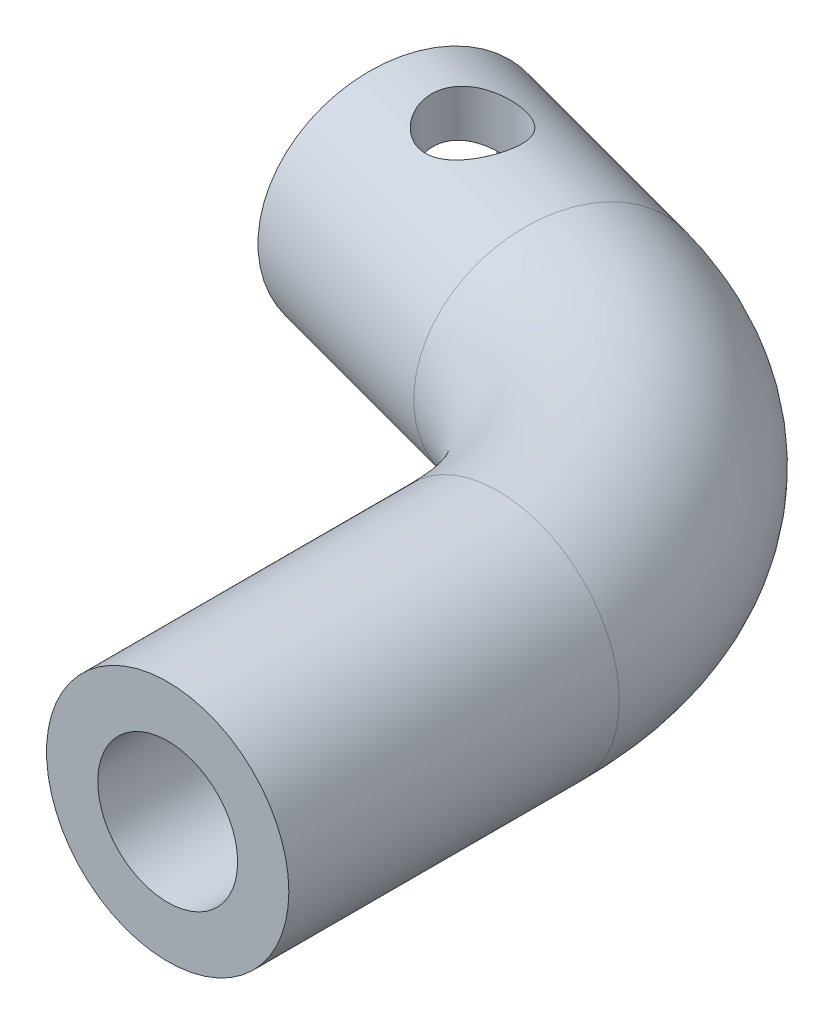
ISO-10303-21;
HEADER;
FILE_DESCRIPTION(('STEP AP214'),'2;1');
FILE_NAME('part.step','',(''),(''),'','','');
FILE_SCHEMA(('AUTOMOTIVE_DESIGN { 1 0 10303 214 1 1 1 1 }'));
ENDSEC;
DATA;
#1=APPLICATION_CONTEXT('core data for automotive mechanical design processes');
#2=APPLICATION_PROTOCOL_DEFINITION('international standard','automotive_design',2000,#1);
#3=PRODUCT_CONTEXT('',#1,'mechanical');
#4=PRODUCT('Part','Part','',(#3));
#5=PRODUCT_RELATED_PRODUCT_CATEGORY('part','',(#4));
#6=PRODUCT_DEFINITION_FORMATION('','',#4);
#7=PRODUCT_DEFINITION_CONTEXT('part definition',#1,'design');
#8=PRODUCT_DEFINITION('design','',#6,#7);
#9=PRODUCT_DEFINITION_SHAPE('','',#8);
#10=(LENGTH_UNIT() NAMED_UNIT(*) SI_UNIT(.MILLI.,.METRE.));
#11=(NAMED_UNIT(*) PLANE_ANGLE_UNIT() SI_UNIT($,.RADIAN.));
#12=(NAMED_UNIT(*) SI_UNIT($,.STERADIAN.) SOLID_ANGLE_UNIT());
#13=UNCERTAINTY_MEASURE_WITH_UNIT(LENGTH_MEASURE(1.E-05),#10,'distance_accuracy_value','');
#14=(GEOMETRIC_REPRESENTATION_CONTEXT(3) GLOBAL_UNCERTAINTY_ASSIGNED_CONTEXT((#13)) GLOBAL_UNIT_ASSIGNED_CONTEXT((#10,
#11,#12)) REPRESENTATION_CONTEXT('',''));
#15=CARTESIAN_POINT('',(0.,0.,0.));
#16=DIRECTION('',(0.,0.,1.));
#17=DIRECTION('',(1.,0.,0.));
#18=AXIS2_PLACEMENT_3D('',#15,#16,#17);
#19=CARTESIAN_POINT('',(-7.0866566905239,0.,-2.49357423980866));
#20=DIRECTION('',(-0.965925826289068,0.,-0.258819045102522));
#21=DIRECTION('',(-0.258819045102522,0.,0.965925826289068));
#22=AXIS2_PLACEMENT_3D('',#19,#20,#21);
#23=CYLINDRICAL_SURFACE('',#22,3.4);
#24=CARTESIAN_POINT('',(-16.7459149534146,0.,-5.08176469083388));
#25=DIRECTION('',(-0.965925826289068,0.,-0.258819045102522));
#26=DIRECTION('',(-0.258819045102522,0.,0.965925826289068));
#27=AXIS2_PLACEMENT_3D('',#24,#25,#26);
#28=CIRCLE('',#27,3.4);
#29=CARTESIAN_POINT('',(-17.6258997067632,0.,-1.79761688145105));
#30=VERTEX_POINT('',#29);
#31=EDGE_CURVE('E120',#30,#30,#28,.T.);
#32=ORIENTED_EDGE('',*,*,#31,.T.);
#33=EDGE_LOOP('',(#32));
#34=FACE_BOUND('',#33,.T.);
#35=CARTESIAN_POINT('',(-12.6434874238193,2.79784724251184,-5.98252254727162));
#36=CARTESIAN_POINT('',(-12.5509977166354,2.78132692335799,-5.98251502304865));
#37=CARTESIAN_POINT('',(-12.4577247348945,2.76851473526521,-5.97607794566917));
#38=CARTESIAN_POINT('',(-12.2721088046783,2.75210078506773,-5.94997631075224));
#39=CARTESIAN_POINT('',(-12.1797670375902,2.74850953894781,-5.93029668304177));
#40=CARTESIAN_POINT('',(-11.9989245557529,2.75110334034966,-5.87814641710598));
#41=CARTESIAN_POINT('',(-11.9104232637114,2.75728691327428,-5.84567770875418));
#42=CARTESIAN_POINT('',(-11.7397605562056,2.77850448159949,-5.76915027512407));
#43=CARTESIAN_POINT('',(-11.6576008761873,2.79354089002309,-5.72508839169848));
#44=CARTESIAN_POINT('',(-11.5008705730949,2.8306112843717,-5.62661784003263));
#45=CARTESIAN_POINT('',(-11.4263460469604,2.852684803993,-5.57215143050944));
#46=CARTESIAN_POINT('',(-11.2863319423716,2.90147030908366,-5.45442852357142));
#47=CARTESIAN_POINT('',(-11.2208468192558,2.92818456733291,-5.39116772219108));
#48=CARTESIAN_POINT('',(-11.0886269321509,2.988978415785,-5.24497227171155));
#49=CARTESIAN_POINT('',(-11.0237556725078,3.02352153529389,-5.16054148040168));
#50=CARTESIAN_POINT('',(-10.9081243960077,3.092587177802,-4.98242442086191));
#51=CARTESIAN_POINT('',(-10.8573768783587,3.12710965574813,-4.8887300533005));
#52=CARTESIAN_POINT('',(-10.7663891199434,3.19669177768806,-4.68287444816542));
#53=CARTESIAN_POINT('',(-10.7278901286475,3.23140206920926,-4.56981288056805));
#54=CARTESIAN_POINT('',(-10.6714515971457,3.29321678870814,-4.33667194321603));
#55=CARTESIAN_POINT('',(-10.6534951437899,3.32032745972455,-4.21659843229962));
#56=CARTESIAN_POINT('',(-10.6403752062763,3.36183481262386,-3.983440735266));
#57=CARTESIAN_POINT('',(-10.6434214662416,3.37710914484058,-3.87061825108027));
#58=CARTESIAN_POINT('',(-10.6687445528547,3.39673788960293,-3.64621390600621));
#59=CARTESIAN_POINT('',(-10.6910028660674,3.40110279909627,-3.53463095547395));
#60=CARTESIAN_POINT('',(-10.7501470904206,3.39858016841131,-3.33049576159959));
#61=CARTESIAN_POINT('',(-10.7848869735867,3.39301574638088,-3.23729512980829));
#62=CARTESIAN_POINT('',(-10.8673697339945,3.37366431697893,-3.05777270667968));
#63=CARTESIAN_POINT('',(-10.9151132577211,3.35987690075516,-2.97145125762146));
#64=CARTESIAN_POINT('',(-11.02185199992,3.32532604548619,-2.80785923779045));
#65=CARTESIAN_POINT('',(-11.080831217142,3.30457249557535,-2.73057604484077));
#66=CARTESIAN_POINT('',(-11.2083462498136,3.25774706784813,-2.58622229589301));
#67=CARTESIAN_POINT('',(-11.2768844659911,3.23167385324235,-2.51915431430953));
#68=CARTESIAN_POINT('',(-11.4301710374368,3.17294931974112,-2.38907343080668));
#69=CARTESIAN_POINT('',(-11.5158759475419,3.13988762900382,-2.32737444255834));
#70=CARTESIAN_POINT('',(-11.6955452693855,3.07228656479666,-2.21830270400856));
#71=CARTESIAN_POINT('',(-11.7895200308535,3.03774536827297,-2.17094824465444));
#72=CARTESIAN_POINT('',(-11.995420345888,2.96640449741547,-2.08680155491752));
#73=CARTESIAN_POINT('',(-12.1081694503685,2.92979872576993,-2.05183822023312));
#74=CARTESIAN_POINT('',(-12.339949396866,2.86343915362755,-2.00215576647098));
#75=CARTESIAN_POINT('',(-12.4589698039322,2.83367438685838,-1.98740405668876));
#76=CARTESIAN_POINT('',(-12.6719742176707,2.79163184050191,-1.98058670763484));
#77=CARTESIAN_POINT('',(-12.7653277535708,2.77689520102091,-1.98403479518045));
#78=CARTESIAN_POINT('',(-12.9515543613258,2.75636980187349,-2.00417992931776));
#79=CARTESIAN_POINT('',(-13.0444278660721,2.75057064292034,-2.02086154361732));
#80=CARTESIAN_POINT('',(-13.2271303703441,2.74876973521872,-2.06725234453382));
#81=CARTESIAN_POINT('',(-13.3169539514218,2.75278458397557,-2.09698353091494));
#82=CARTESIAN_POINT('',(-13.4907800320611,2.77003487927546,-2.16842757248554));
#83=CARTESIAN_POINT('',(-13.5747782667515,2.78327700457491,-2.21014909348873));
#84=CARTESIAN_POINT('',(-13.7342743346614,2.8170302156006,-2.30363506531909));
#85=CARTESIAN_POINT('',(-13.8098410612864,2.83747567291875,-2.35530699349969));
#86=CARTESIAN_POINT('',(-13.9523096477581,2.88342742744479,-2.4675247946412));
#87=CARTESIAN_POINT('',(-14.0192082551889,2.90893561523295,-2.52807398043104));
#88=CARTESIAN_POINT('',(-14.1542798605755,2.9673502161095,-2.66780690767005));
#89=CARTESIAN_POINT('',(-14.2207592959059,3.000778490498,-2.74841069409341));
#90=CARTESIAN_POINT('',(-14.3403547434096,3.06831322208068,-2.91880660578172));
#91=CARTESIAN_POINT('',(-14.3934584036777,3.10242027496825,-3.00860711695858));
#92=CARTESIAN_POINT('',(-14.4912461932212,3.1726373897699,-3.20814797605332));
#93=CARTESIAN_POINT('',(-14.5339742535216,3.20844248182199,-3.31896816756137));
#94=CARTESIAN_POINT('',(-14.5994037853697,3.27331487103472,-3.5482688740777));
#95=CARTESIAN_POINT('',(-14.6221169567876,3.30238609719615,-3.66674487028526));
#96=CARTESIAN_POINT('',(-14.6449826367471,3.34878893748277,-3.89996350651461));
#97=CARTESIAN_POINT('',(-14.6465264811939,3.36676924496401,-4.01443569269851));
#98=CARTESIAN_POINT('',(-14.6297407181514,3.39174530649408,-4.2430929285664));
#99=CARTESIAN_POINT('',(-14.6114331326677,3.39875321162156,-4.35727815587118));
#100=CARTESIAN_POINT('',(-14.5590225834086,3.40080077367047,-4.56630412413817));
#101=CARTESIAN_POINT('',(-14.5272780742946,3.39727572496818,-4.66173209859512));
#102=CARTESIAN_POINT('',(-14.4501763719273,3.38163742645076,-4.84615463804876));
#103=CARTESIAN_POINT('',(-14.4048190286191,3.36952408196439,-4.93514913211547));
#104=CARTESIAN_POINT('',(-14.303079836114,3.33811474627225,-5.10288454378741));
#105=CARTESIAN_POINT('',(-14.2469124928609,3.31895279131746,-5.18178195274159));
#106=CARTESIAN_POINT('',(-14.1247715707496,3.27498226194515,-5.32974484304168));
#107=CARTESIAN_POINT('',(-14.0587968744348,3.25017304390312,-5.39880920224505));
#108=CARTESIAN_POINT('',(-13.9113154654831,3.19392719653635,-5.53286210646646));
#109=CARTESIAN_POINT('',(-13.8289069844003,3.16206963585657,-5.59667955190476));
#110=CARTESIAN_POINT('',(-13.6556841318615,3.09626463707063,-5.71059276171686));
#111=CARTESIAN_POINT('',(-13.5648555982816,3.06231371135236,-5.76066482560655));
#112=CARTESIAN_POINT('',(-13.3646070620085,2.99106003847046,-5.85162607134827));
#113=CARTESIAN_POINT('',(-13.2542779436206,2.95386323938206,-5.89060860995819));
#114=CARTESIAN_POINT('',(-13.0270955014092,2.88518705487805,-5.94886186635392));
#115=CARTESIAN_POINT('',(-12.9102686692384,2.85368640181053,-5.96820720697565));
#116=CARTESIAN_POINT('',(-12.7425360680585,2.81664742678897,-5.98067876758858));
#117=CARTESIAN_POINT('',(-12.6931245462789,2.80671332209928,-5.98252658535097));
#118=CARTESIAN_POINT('',(-12.6434874238193,2.79784724251184,-5.98252254727162));
#119=B_SPLINE_CURVE_WITH_KNOTS('',3,(#35,#36,#37,#38,#39,#40,#41,#42,#43,#44,#45,#46,#47,#48,
#49,#50,#51,#52,#53,#54,#55,#56,#57,#58,#59,#60,#61,#62,#63,#64,#65,#66,#67,#68,#69,#70,#71,#72,
#73,#74,#75,#76,#77,#78,#79,#80,#81,#82,#83,#84,#85,#86,#87,#88,#89,#90,#91,#92,#93,#94,#95,#96,
#97,#98,#99,#100,#101,#102,#103,#104,#105,#106,#107,#108,#109,#110,#111,#112,#113,#114,#115,
#116,#117,#118),.UNSPECIFIED.,.T.,.F.,(4,2,2,2,2,2,2,2,2,2,2,2,2,2,2,2,2,2,2,2,2,2,2,2,2,2,2,2,
2,2,2,2,2,2,2,2,2,2,2,2,2,4),(0.,0.281710490832139,0.563742114806932,0.845731196476121,
1.12779717569574,1.41147655248892,1.69529525362456,2.02977638654681,2.36455259359307,
2.73571107125314,3.1065637450767,3.44622077395405,3.78555086188096,4.0829731735272,
4.38041027442436,4.67742690646618,4.97451826855614,5.30517010727795,5.63624180787377,
6.00520098096144,6.37356451429013,6.65606965441582,6.93824583427887,7.22089956215948,
7.50375808925177,7.78410348170774,8.06455376145581,8.39237704568259,8.72050195863466,
9.09075073890558,9.46078294331528,9.8063689841024,10.1515720439673,10.4519716505313,
10.752374568537,11.0473377541381,11.3423345738506,11.6680144986619,11.994252499628,
12.3609146736157,12.7261782278226,12.8773658416376),.UNSPECIFIED.);
#120=CARTESIAN_POINT('',(-12.6434874238193,2.79784724251184,-5.98252254727162));
#121=VERTEX_POINT('',#120);
#122=EDGE_CURVE('E39',#121,#121,#119,.T.);
#123=ORIENTED_EDGE('',*,*,#122,.F.);
#124=EDGE_LOOP('',(#123));
#125=FACE_BOUND('',#124,.T.);
#126=DIRECTION('',(0.965925826289068,0.,0.258819045102522));
#127=VECTOR('',#126,1.);
#128=CARTESIAN_POINT('',(-8.62121759132007,-3.38384857516461,-2.56206994846308));
#129=LINE('',#128,#127);
#130=CARTESIAN_POINT('',(-8.62121759132007,-3.38384857516461,-2.56206994846308));
#131=VERTEX_POINT('',#130);
#132=CARTESIAN_POINT('',(-7.17232885188647,-3.38384857516461,-2.1738413808093));
#133=VERTEX_POINT('',#132);
#134=EDGE_CURVE('E93',#131,#133,#129,.T.);
#135=ORIENTED_EDGE('',*,*,#134,.T.);
#136=CARTESIAN_POINT('',(-7.0866566905239,0.,-2.49357423980866));
#137=DIRECTION('',(-0.965925826289068,0.,-0.258819045102522));
#138=DIRECTION('',(-0.258819045102522,0.,0.965925826289068));
#139=AXIS2_PLACEMENT_3D('',#136,#137,#138);
#140=CIRCLE('',#139,3.4);
#141=CARTESIAN_POINT('',(-6.74990110468351,3.14119041053837,-3.75036319589759));
#142=VERTEX_POINT('',#141);
#143=EDGE_CURVE('E187',#142,#133,#140,.T.);
#144=ORIENTED_EDGE('',*,*,#143,.F.);
#145=DIRECTION('',(0.965925826289068,0.,0.258819045102522));
#146=VECTOR('',#145,1.);
#147=CARTESIAN_POINT('',(-8.19878984411712,3.14119041053837,-4.13859176355137));
#148=LINE('',#147,#146);
#149=CARTESIAN_POINT('',(-8.19878984411712,3.14119041053837,-4.13859176355137));
#150=VERTEX_POINT('',#149);
#151=EDGE_CURVE('E100',#150,#142,#148,.T.);
#152=ORIENTED_EDGE('',*,*,#151,.F.);
#153=CARTESIAN_POINT('',(-8.5355454299575,0.,-2.88180280746244));
#154=DIRECTION('',(-0.965925826289068,0.,-0.258819045102522));
#155=DIRECTION('',(-0.258819045102522,0.,0.965925826289068));
#156=AXIS2_PLACEMENT_3D('',#153,#154,#155);
#157=CIRCLE('',#156,3.4);
#158=CARTESIAN_POINT('',(-8.44987326859492,3.38384857516461,-3.20153566646181));
#159=VERTEX_POINT('',#158);
#160=EDGE_CURVE('E89',#159,#150,#157,.T.);
#161=ORIENTED_EDGE('',*,*,#160,.F.);
#162=DIRECTION('',(0.965925826289068,0.,0.258819045102522));
#163=VECTOR('',#162,1.);
#164=CARTESIAN_POINT('',(-8.44987326859492,3.38384857516461,-3.20153566646181));
#165=LINE('',#164,#163);
#166=CARTESIAN_POINT('',(-7.00098452916132,3.38384857516461,-2.81330709880803));
#167=VERTEX_POINT('',#166);
#168=EDGE_CURVE('E104',#159,#167,#165,.T.);
#169=ORIENTED_EDGE('',*,*,#168,.T.);
#170=CARTESIAN_POINT('',(-7.42341227636428,-3.14119041053837,-1.23678528371974));
#171=VERTEX_POINT('',#170);
#172=EDGE_CURVE('E121',#171,#167,#140,.T.);
#173=ORIENTED_EDGE('',*,*,#172,.F.);
#174=DIRECTION('',(0.965925826289068,0.,0.258819045102522));
#175=VECTOR('',#174,1.);
#176=CARTESIAN_POINT('',(-8.87230101579788,-3.14119041053837,-1.62501385137352));
#177=LINE('',#176,#175);
#178=CARTESIAN_POINT('',(-8.87230101579788,-3.14119041053837,-1.62501385137352));
#179=VERTEX_POINT('',#178);
#180=EDGE_CURVE('E56',#179,#171,#177,.T.);
#181=ORIENTED_EDGE('',*,*,#180,.F.);
#182=CARTESIAN_POINT('',(-8.5355454299575,0.,-2.88180280746244));
#183=DIRECTION('',(-0.965925826289068,0.,-0.258819045102522));
#184=DIRECTION('',(-0.258819045102522,0.,0.965925826289068));
#185=AXIS2_PLACEMENT_3D('',#182,#183,#184);
#186=CIRCLE('',#185,3.4);
#187=EDGE_CURVE('E87',#131,#179,#186,.T.);
#188=ORIENTED_EDGE('',*,*,#187,.F.);
#189=EDGE_LOOP('',(#135,#144,#152,#161,#169,#173,#181,#188));
#190=FACE_BOUND('',#189,.T.);
#191=ADVANCED_FACE('F35',(#34,#125,#190),#23,.F.);
#192=CARTESIAN_POINT('',(-7.0866566905239,0.,-2.49357423980866));
#193=DIRECTION('',(-0.965925826289068,0.,-0.258819045102522));
#194=DIRECTION('',(-0.258819045102522,0.,0.965925826289068));
#195=AXIS2_PLACEMENT_3D('',#192,#193,#194);
#196=PLANE('',#195);
#197=ORIENTED_EDGE('',*,*,#143,.T.);
#198=DIRECTION('',(-0.062804554454894,-0.970111857024861,0.23438978817239));
#199=VECTOR('',#198,1.);
#200=CARTESIAN_POINT('',(-6.74990110468351,3.14119041053837,-3.75036319589759));
#201=LINE('',#200,#199);
#202=EDGE_CURVE('E96',#142,#133,#201,.T.);
#203=ORIENTED_EDGE('',*,*,#202,.F.);
#204=EDGE_LOOP('',(#197,#203));
#205=FACE_BOUND('',#204,.T.);
#206=ADVANCED_FACE('F134',(#205),#196,.T.);
#207=ORIENTED_EDGE('',*,*,#172,.T.);
#208=DIRECTION('',(0.062804554454894,0.970111857024861,-0.23438978817239));
#209=VECTOR('',#208,1.);
#210=CARTESIAN_POINT('',(-7.00098452916132,3.38384857516461,-2.81330709880803));
#211=LINE('',#210,#209);
#212=EDGE_CURVE('E77',#171,#167,#211,.T.);
#213=ORIENTED_EDGE('',*,*,#212,.F.);
#214=EDGE_LOOP('',(#207,#213));
#215=FACE_BOUND('',#214,.T.);
#216=ADVANCED_FACE('F137',(#215),#196,.T.);
#217=CARTESIAN_POINT('',(-7.0866566905239,0.,-2.49357423980866));
#218=DIRECTION('',(-0.965925826289068,0.,-0.258819045102522));
#219=DIRECTION('',(-0.258819045102522,0.,0.965925826289068));
#220=AXIS2_PLACEMENT_3D('',#217,#218,#219);
#221=CYLINDRICAL_SURFACE('',#220,5.5);
#222=CARTESIAN_POINT('',(-16.7459149534146,0.,-5.08176469083388));
#223=DIRECTION('',(0.965925826289068,0.,0.258819045102522));
#224=DIRECTION('',(0.258819045102522,0.,-0.965925826289068));
#225=AXIS2_PLACEMENT_3D('',#222,#223,#224);
#226=CIRCLE('',#225,5.5);
#227=CARTESIAN_POINT('',(-15.3224102053507,0.,-10.3943567354237));
#228=VERTEX_POINT('',#227);
#229=EDGE_CURVE('E11',#228,#228,#226,.T.);
#230=ORIENTED_EDGE('',*,*,#229,.T.);
#231=EDGE_LOOP('',(#230));
#232=FACE_BOUND('',#231,.T.);
#233=CARTESIAN_POINT('',(-7.0866566905239,0.,-2.49357423980866));
#234=DIRECTION('',(0.965925826289068,0.,0.258819045102522));
#235=DIRECTION('',(0.258819045102522,0.,-0.965925826289068));
#236=AXIS2_PLACEMENT_3D('',#233,#234,#235);
#237=CIRCLE('',#236,5.5);
#238=CARTESIAN_POINT('',(-5.66315194246003,0.,-7.80616628439854));
#239=VERTEX_POINT('',#238);
#240=EDGE_CURVE('E49',#239,#239,#237,.T.);
#241=ORIENTED_EDGE('',*,*,#240,.F.);
#242=EDGE_LOOP('',(#241));
#243=FACE_BOUND('',#242,.T.);
#244=CARTESIAN_POINT('',(-14.5753390763974,5.5,-4.50016063747666));
#245=CARTESIAN_POINT('',(-14.6034348323689,5.50000205657184,-4.39531671702574));
#246=CARTESIAN_POINT('',(-14.6229578753464,5.49675838182447,-4.28819624186685));
#247=CARTESIAN_POINT('',(-14.6443933468312,5.4841414750815,-4.07258098099718));
#248=CARTESIAN_POINT('',(-14.6463071283291,5.47476871406757,-3.96408630151349));
#249=CARTESIAN_POINT('',(-14.6327244245639,5.45090325673945,-3.74899991198221));
#250=CARTESIAN_POINT('',(-14.6172601771137,5.43642007485985,-3.64240504971301));
#251=CARTESIAN_POINT('',(-14.5696627633705,5.40378627100061,-3.43359287136094));
#252=CARTESIAN_POINT('',(-14.5375254220274,5.38563473113581,-3.33137665866358));
#253=CARTESIAN_POINT('',(-14.4560957733966,5.34673088503245,-3.13007677419475));
#254=CARTESIAN_POINT('',(-14.4062227052787,5.32590805596802,-3.03124177545708));
#255=CARTESIAN_POINT('',(-14.2908704225606,5.28436672781322,-2.84308733702261));
#256=CARTESIAN_POINT('',(-14.2253868476186,5.26364825952702,-2.75377056607097));
#257=CARTESIAN_POINT('',(-14.0776932416296,5.2238538559819,-2.58389483421586));
#258=CARTESIAN_POINT('',(-13.9949735104805,5.20486193866807,-2.50375738525143));
#259=CARTESIAN_POINT('',(-13.816412696506,5.17176122573932,-2.35849101953616));
#260=CARTESIAN_POINT('',(-13.720576516487,5.15765061245797,-2.29335651911612));
#261=CARTESIAN_POINT('',(-13.522439417472,5.13666087499578,-2.18257352380886));
#262=CARTESIAN_POINT('',(-13.4205367284554,5.12952103621697,-2.13626379474887));
#263=CARTESIAN_POINT('',(-13.2102248207883,5.12251577517209,-2.06125727087293));
#264=CARTESIAN_POINT('',(-13.1018181032329,5.12264757431404,-2.03255375272299));
#265=CARTESIAN_POINT('',(-12.8881463561737,5.1299448506341,-1.99474539692812));
#266=CARTESIAN_POINT('',(-12.7830429962982,5.13671788212537,-1.98463735806409));
#267=CARTESIAN_POINT('',(-12.5730724026341,5.15588510806292,-1.98100533295381));
#268=CARTESIAN_POINT('',(-12.4682052043793,5.16828009813625,-1.98748369463997));
#269=CARTESIAN_POINT('',(-12.2594785399306,5.19754287313288,-2.01685474292724));
#270=CARTESIAN_POINT('',(-12.1556720782538,5.21448789682278,-2.04004378144439));
#271=CARTESIAN_POINT('',(-11.9534214206665,5.25091385937534,-2.10235883263469));
#272=CARTESIAN_POINT('',(-11.8549790093036,5.27039563496267,-2.14149011281811));
#273=CARTESIAN_POINT('',(-11.6596080194338,5.31119569956226,-2.23765410964969));
#274=CARTESIAN_POINT('',(-11.5631640704988,5.33255243042912,-2.29565794277164));
#275=CARTESIAN_POINT('',(-11.3811075170221,5.3736374984068,-2.42720556597556));
#276=CARTESIAN_POINT('',(-11.2954963849895,5.39336561401291,-2.50075146507635));
#277=CARTESIAN_POINT('',(-11.1363777039833,5.42932219694274,-2.66279369611515));
#278=CARTESIAN_POINT('',(-11.0630529733992,5.44549875602857,-2.75148187793042));
#279=CARTESIAN_POINT('',(-10.9324009700414,5.47214720693442,-2.94070375147052));
#280=CARTESIAN_POINT('',(-10.8750670391238,5.48262147477141,-3.04123248823007));
#281=CARTESIAN_POINT('',(-10.7809000556221,5.49627428963535,-3.2457731695854));
#282=CARTESIAN_POINT('',(-10.7431787026224,5.49979422865534,-3.34935355964349));
#283=CARTESIAN_POINT('',(-10.6852645431481,5.50018795318754,-3.56130361778763));
#284=CARTESIAN_POINT('',(-10.6650681238082,5.49706310901842,-3.66967229389758));
#285=CARTESIAN_POINT('',(-10.6431179739982,5.48474392235953,-3.88396689472239));
#286=CARTESIAN_POINT('',(-10.6407319882517,5.47577009231647,-3.98984203805255));
#287=CARTESIAN_POINT('',(-10.6525705595979,5.45287588831335,-4.20010650941416));
#288=CARTESIAN_POINT('',(-10.6667972776095,5.43895487100538,-4.30449564236294));
#289=CARTESIAN_POINT('',(-10.7118837264167,5.40705571750078,-4.51216461500609));
#290=CARTESIAN_POINT('',(-10.7432085230728,5.38897272874452,-4.61532689539351));
#291=CARTESIAN_POINT('',(-10.8218088924197,5.35076522574993,-4.81499389982384));
#292=CARTESIAN_POINT('',(-10.8690900974622,5.3306399923892,-4.91149625851506));
#293=CARTESIAN_POINT('',(-10.9814495187459,5.28921180356834,-5.10072899462701));
#294=CARTESIAN_POINT('',(-11.047356952905,5.26790441656513,-5.19296748182463));
#295=CARTESIAN_POINT('',(-11.1941013152038,5.22759328693504,-5.3653050928413));
#296=CARTESIAN_POINT('',(-11.2749391773269,5.20858968854653,-5.44540345665535));
#297=CARTESIAN_POINT('',(-11.4498084389685,5.17515419274761,-5.59128478822209));
#298=CARTESIAN_POINT('',(-11.5438672819594,5.16073201356675,-5.65703723377893));
#299=CARTESIAN_POINT('',(-11.7424247776252,5.13846087649098,-5.77171518095577));
#300=CARTESIAN_POINT('',(-11.8469174532709,5.13060817917034,-5.82065024586515));
#301=CARTESIAN_POINT('',(-12.0564475562389,5.12284228170685,-5.8974831604682));
#302=CARTESIAN_POINT('',(-12.1610671956754,5.1224762355533,-5.92647734792719));
#303=CARTESIAN_POINT('',(-12.3734152323768,5.12857566975998,-5.96714957202016));
#304=CARTESIAN_POINT('',(-12.4811433689737,5.13504057890957,-5.97882905632901));
#305=CARTESIAN_POINT('',(-12.6936033068151,5.15370717596286,-5.98464232882253));
#306=CARTESIAN_POINT('',(-12.7983375689898,5.16574946028865,-5.97924077396964));
#307=CARTESIAN_POINT('',(-13.005110853157,5.19413013423955,-5.95232106074428));
#308=CARTESIAN_POINT('',(-13.1071492075325,5.21046957724445,-5.93079894828072));
#309=CARTESIAN_POINT('',(-13.3112325963848,5.24662240525316,-5.87090424053339));
#310=CARTESIAN_POINT('',(-13.4130219596419,5.26656880255672,-5.83174161699873));
#311=CARTESIAN_POINT('',(-13.6088066522759,5.30720401505186,-5.73750691528494));
#312=CARTESIAN_POINT('',(-13.7027995680022,5.32789305733489,-5.68242993376981));
#313=CARTESIAN_POINT('',(-13.8852462087076,5.36891606148755,-5.55448022829524));
#314=CARTESIAN_POINT('',(-13.973193331767,5.38918141250994,-5.48085981914261));
#315=CARTESIAN_POINT('',(-14.1356112407902,5.42597802894301,-5.31919444713716));
#316=CARTESIAN_POINT('',(-14.2100823205517,5.44250937576248,-5.23114979883397));
#317=CARTESIAN_POINT('',(-14.344337861416,5.47019903727863,-5.04123251753136));
#318=CARTESIAN_POINT('',(-14.403830859287,5.48125425902285,-4.9391376851678));
#319=CARTESIAN_POINT('',(-14.5040407167505,5.49615207881264,-4.72564471084396));
#320=CARTESIAN_POINT('',(-14.5447656022209,5.49999776206249,-4.61425056969756));
#321=CARTESIAN_POINT('',(-14.5753390763974,5.5,-4.50016063747666));
#322=B_SPLINE_CURVE_WITH_KNOTS('',3,(#244,#245,#246,#247,#248,#249,#250,#251,#252,#253,#254,
#255,#256,#257,#258,#259,#260,#261,#262,#263,#264,#265,#266,#267,#268,#269,#270,#271,#272,#273,
#274,#275,#276,#277,#278,#279,#280,#281,#282,#283,#284,#285,#286,#287,#288,#289,#290,#291,#292,
#293,#294,#295,#296,#297,#298,#299,#300,#301,#302,#303,#304,#305,#306,#307,#308,#309,#310,#311,
#312,#313,#314,#315,#316,#317,#318,#319,#320,#321),.UNSPECIFIED.,.T.,.F.,(4,2,2,2,2,2,2,2,2,2,2,
2,2,2,2,2,2,2,2,2,2,2,2,2,2,2,2,2,2,2,2,2,2,2,2,2,2,2,4),(0.,0.325194104136431,
0.650363222090039,0.974930116318938,1.29957832344219,1.63601964163853,1.97255504528971,
2.32099392094053,2.66930290729856,3.00401939097087,3.33860797579857,3.65454759073094,
3.97053193181531,4.29226244373355,4.61409934564611,4.95617818949658,5.29830348241717,
5.64513792605579,5.99182774072784,6.32102805388949,6.65016048438683,6.96755079702181,
7.2849823992121,7.61151258405805,7.93815814949471,8.28259860829995,8.62706062112334,
8.97224851093865,9.31723978183251,9.64129740492554,9.96532793217199,10.2806204101951,
10.5959902492892,10.9271566786297,11.2584252518918,11.6061385710831,11.9538443086926,
12.3078682758854,12.6617407096898),.UNSPECIFIED.);
#323=CARTESIAN_POINT('',(-14.5753390763974,5.5,-4.50016063747666));
#324=VERTEX_POINT('',#323);
#325=EDGE_CURVE('E113',#324,#324,#322,.T.);
#326=ORIENTED_EDGE('',*,*,#325,.F.);
#327=EDGE_LOOP('',(#326));
#328=FACE_BOUND('',#327,.T.);
#329=ADVANCED_FACE('F123',(#232,#243,#328),#221,.T.);
#330=CARTESIAN_POINT('',(2.5,0.,25.));
#331=DIRECTION('',(0.,0.,1.));
#332=DIRECTION('',(1.,0.,0.));
#333=AXIS2_PLACEMENT_3D('',#330,#331,#332);
#334=PLANE('',#333);
#335=CARTESIAN_POINT('',(2.5,0.,25.));
#336=DIRECTION('',(0.,0.,1.));
#337=DIRECTION('',(1.,0.,0.));
#338=AXIS2_PLACEMENT_3D('',#335,#336,#337);
#339=CIRCLE('',#338,3.175);
#340=CARTESIAN_POINT('',(5.675,0.,25.));
#341=VERTEX_POINT('',#340);
#342=EDGE_CURVE('E184',#341,#341,#339,.T.);
#343=ORIENTED_EDGE('',*,*,#342,.F.);
#344=EDGE_LOOP('',(#343));
#345=FACE_BOUND('',#344,.T.);
#346=CARTESIAN_POINT('',(2.5,0.,25.));
#347=DIRECTION('',(0.,0.,1.));
#348=DIRECTION('',(1.,0.,0.));
#349=AXIS2_PLACEMENT_3D('',#346,#347,#348);
#350=CIRCLE('',#349,5.5);
#351=CARTESIAN_POINT('',(8.,0.,25.));
#352=VERTEX_POINT('',#351);
#353=EDGE_CURVE('E178',#352,#352,#350,.T.);
#354=ORIENTED_EDGE('',*,*,#353,.T.);
#355=EDGE_LOOP('',(#354));
#356=FACE_BOUND('',#355,.T.);
#357=ADVANCED_FACE('F37',(#345,#356),#334,.T.);
#358=CARTESIAN_POINT('',(-16.7459149534146,0.,-5.08176469083388));
#359=DIRECTION('',(0.965925826289068,0.,0.258819045102522));
#360=DIRECTION('',(0.258819045102522,0.,-0.965925826289068));
#361=AXIS2_PLACEMENT_3D('',#358,#359,#360);
#362=PLANE('',#361);
#363=ORIENTED_EDGE('',*,*,#31,.F.);
#364=EDGE_LOOP('',(#363));
#365=FACE_BOUND('',#364,.T.);
#366=ORIENTED_EDGE('',*,*,#229,.F.);
#367=EDGE_LOOP('',(#366));
#368=FACE_BOUND('',#367,.T.);
#369=ADVANCED_FACE('F153',(#365,#368),#362,.F.);
#370=CARTESIAN_POINT('',(2.5,0.,25.));
#371=DIRECTION('',(0.,0.,-1.));
#372=DIRECTION('',(-1.,0.,0.));
#373=AXIS2_PLACEMENT_3D('',#370,#371,#372);
#374=CYLINDRICAL_SURFACE('',#373,5.5);
#375=CARTESIAN_POINT('',(2.5,0.,10.));
#376=DIRECTION('',(0.,0.,1.));
#377=DIRECTION('',(1.,0.,0.));
#378=AXIS2_PLACEMENT_3D('',#375,#376,#377);
#379=CIRCLE('',#378,5.5);
#380=CARTESIAN_POINT('',(8.,0.,10.));
#381=VERTEX_POINT('',#380);
#382=EDGE_CURVE('E175',#381,#381,#379,.T.);
#383=ORIENTED_EDGE('',*,*,#382,.T.);
#384=EDGE_LOOP('',(#383));
#385=FACE_BOUND('',#384,.T.);
#386=ORIENTED_EDGE('',*,*,#353,.F.);
#387=EDGE_LOOP('',(#386));
#388=FACE_BOUND('',#387,.T.);
#389=ADVANCED_FACE('F151',(#385,#388),#374,.T.);
#390=CARTESIAN_POINT('',(-10.4342998186589,0.,10.));
#391=DIRECTION('',(0.,1.,0.));
#392=DIRECTION('',(0.,0.,1.));
#393=AXIS2_PLACEMENT_3D('',#390,#391,#392);
#394=TOROIDAL_SURFACE('',#393,12.9342998186589,5.5);
#395=CARTESIAN_POINT('',(-10.4342998186589,0.,10.));
#396=DIRECTION('',(0.,1.,0.));
#397=DIRECTION('',(0.,0.,1.));
#398=AXIS2_PLACEMENT_3D('',#395,#396,#397);
#399=CIRCLE('',#398,18.4342998186589);
#400=EDGE_CURVE('',#381,#239,#399,.T.);
#401=ORIENTED_EDGE('',*,*,#382,.F.);
#402=ORIENTED_EDGE('',*,*,#240,.T.);
#403=ORIENTED_EDGE('',*,*,#400,.T.);
#404=ORIENTED_EDGE('',*,*,#400,.F.);
#405=EDGE_LOOP('',(#401,#403,#402,#404));
#406=FACE_BOUND('',#405,.T.);
#407=ADVANCED_FACE('F149',(#406),#394,.T.);
#408=CARTESIAN_POINT('',(2.5,0.,15.));
#409=DIRECTION('',(0.,0.,1.));
#410=DIRECTION('',(1.,0.,0.));
#411=AXIS2_PLACEMENT_3D('',#408,#409,#410);
#412=CYLINDRICAL_SURFACE('',#411,3.175);
#413=CARTESIAN_POINT('',(2.5,0.,15.));
#414=DIRECTION('',(0.,0.,1.));
#415=DIRECTION('',(1.,0.,0.));
#416=AXIS2_PLACEMENT_3D('',#413,#414,#415);
#417=CIRCLE('',#416,3.175);
#418=CARTESIAN_POINT('',(5.675,0.,15.));
#419=VERTEX_POINT('',#418);
#420=EDGE_CURVE('E183',#419,#419,#417,.T.);
#421=ORIENTED_EDGE('',*,*,#420,.F.);
#422=EDGE_LOOP('',(#421));
#423=FACE_BOUND('',#422,.T.);
#424=ORIENTED_EDGE('',*,*,#342,.T.);
#425=EDGE_LOOP('',(#424));
#426=FACE_BOUND('',#425,.T.);
#427=ADVANCED_FACE('F145',(#423,#426),#412,.F.);
#428=CARTESIAN_POINT('',(2.5,0.,15.));
#429=DIRECTION('',(0.,0.,1.));
#430=DIRECTION('',(1.,0.,0.));
#431=AXIS2_PLACEMENT_3D('',#428,#429,#430);
#432=PLANE('',#431);
#433=ORIENTED_EDGE('',*,*,#420,.T.);
#434=EDGE_LOOP('',(#433));
#435=FACE_BOUND('',#434,.T.);
#436=ADVANCED_FACE('F131',(#435),#432,.T.);
#437=CARTESIAN_POINT('',(-12.6434874238193,5.5,-3.98252254727162));
#438=DIRECTION('',(0.,-1.,0.));
#439=DIRECTION('',(0.,0.,-1.));
#440=AXIS2_PLACEMENT_3D('',#437,#438,#439);
#441=CYLINDRICAL_SURFACE('',#440,2.);
#442=ORIENTED_EDGE('',*,*,#122,.T.);
#443=EDGE_LOOP('',(#442));
#444=FACE_BOUND('',#443,.T.);
#445=ORIENTED_EDGE('',*,*,#325,.T.);
#446=EDGE_LOOP('',(#445));
#447=FACE_BOUND('',#446,.T.);
#448=ADVANCED_FACE('F126',(#444,#447),#441,.F.);
#449=CARTESIAN_POINT('',(-8.19878984411712,3.14119041053837,-4.13859176355137));
#450=DIRECTION('',(-0.251083424477809,0.24265816462624,0.937056097089561));
#451=DIRECTION('',(0.965925826289068,0.,0.258819045102522));
#452=AXIS2_PLACEMENT_3D('',#449,#450,#451);
#453=PLANE('',#452);
#454=ORIENTED_EDGE('',*,*,#202,.T.);
#455=ORIENTED_EDGE('',*,*,#134,.F.);
#456=DIRECTION('',(-0.062804554454894,-0.970111857024861,0.23438978817239));
#457=VECTOR('',#456,1.);
#458=CARTESIAN_POINT('',(-8.19878984411712,3.14119041053837,-4.13859176355137));
#459=LINE('',#458,#457);
#460=EDGE_CURVE('E84',#150,#131,#459,.T.);
#461=ORIENTED_EDGE('',*,*,#460,.F.);
#462=ORIENTED_EDGE('',*,*,#151,.T.);
#463=EDGE_LOOP('',(#454,#455,#461,#462));
#464=FACE_BOUND('',#463,.T.);
#465=ADVANCED_FACE('F94',(#464),#453,.F.);
#466=CARTESIAN_POINT('',(-8.44987326859492,3.38384857516461,-3.20153566646181));
#467=DIRECTION('',(0.251083424477809,-0.24265816462624,-0.937056097089561));
#468=DIRECTION('',(-0.965925826289068,0.,-0.258819045102522));
#469=AXIS2_PLACEMENT_3D('',#466,#467,#468);
#470=PLANE('',#469);
#471=ORIENTED_EDGE('',*,*,#212,.T.);
#472=ORIENTED_EDGE('',*,*,#168,.F.);
#473=DIRECTION('',(0.062804554454894,0.970111857024861,-0.23438978817239));
#474=VECTOR('',#473,1.);
#475=CARTESIAN_POINT('',(-8.44987326859492,3.38384857516461,-3.20153566646181));
#476=LINE('',#475,#474);
#477=EDGE_CURVE('E64',#179,#159,#476,.T.);
#478=ORIENTED_EDGE('',*,*,#477,.F.);
#479=ORIENTED_EDGE('',*,*,#180,.T.);
#480=EDGE_LOOP('',(#471,#472,#478,#479));
#481=FACE_BOUND('',#480,.T.);
#482=ADVANCED_FACE('F192',(#481),#470,.F.);
#483=CARTESIAN_POINT('',(-8.5355454299575,0.,-2.88180280746244));
#484=DIRECTION('',(-0.965925826289068,0.,-0.258819045102522));
#485=DIRECTION('',(-0.258819045102522,0.,0.965925826289068));
#486=AXIS2_PLACEMENT_3D('',#483,#484,#485);
#487=PLANE('',#486);
#488=ORIENTED_EDGE('',*,*,#160,.T.);
#489=ORIENTED_EDGE('',*,*,#460,.T.);
#490=ORIENTED_EDGE('',*,*,#187,.T.);
#491=ORIENTED_EDGE('',*,*,#477,.T.);
#492=EDGE_LOOP('',(#488,#489,#490,#491));
#493=FACE_BOUND('',#492,.T.);
#494=ADVANCED_FACE('F85',(#493),#487,.T.);
#495=CLOSED_SHELL('',(#191,#206,#216,#329,#357,#369,#389,#407,#427,#436,#448,#465,#482,#494));
#496=MANIFOLD_SOLID_BREP('B2',#495);
#497=ADVANCED_BREP_SHAPE_REPRESENTATION('',(#18,#496),#14);
#498=SHAPE_DEFINITION_REPRESENTATION(#9,#497);
ENDSEC;
END-ISO-10303-21;
